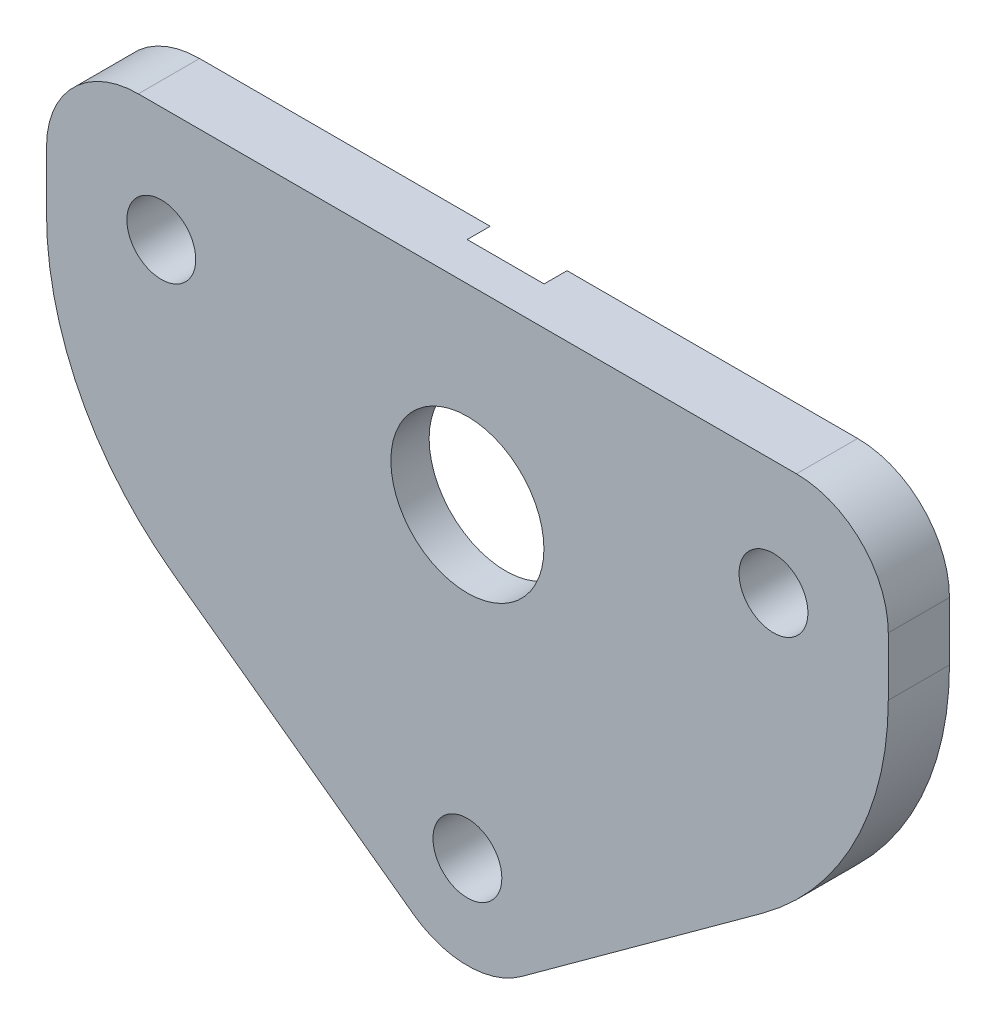
ISO-10303-21;
HEADER;
FILE_DESCRIPTION(('STEP AP214'),'2;1');
FILE_NAME('part.step','',(''),(''),'','','');
FILE_SCHEMA(('AUTOMOTIVE_DESIGN { 1 0 10303 214 1 1 1 1 }'));
ENDSEC;
DATA;
#1=APPLICATION_CONTEXT('core data for automotive mechanical design processes');
#2=APPLICATION_PROTOCOL_DEFINITION('international standard','automotive_design',2000,#1);
#3=PRODUCT_CONTEXT('',#1,'mechanical');
#4=PRODUCT('Part','Part','',(#3));
#5=PRODUCT_RELATED_PRODUCT_CATEGORY('part','',(#4));
#6=PRODUCT_DEFINITION_FORMATION('','',#4);
#7=PRODUCT_DEFINITION_CONTEXT('part definition',#1,'design');
#8=PRODUCT_DEFINITION('design','',#6,#7);
#9=PRODUCT_DEFINITION_SHAPE('','',#8);
#10=(LENGTH_UNIT() NAMED_UNIT(*) SI_UNIT(.MILLI.,.METRE.));
#11=(NAMED_UNIT(*) PLANE_ANGLE_UNIT() SI_UNIT($,.RADIAN.));
#12=(NAMED_UNIT(*) SI_UNIT($,.STERADIAN.) SOLID_ANGLE_UNIT());
#13=UNCERTAINTY_MEASURE_WITH_UNIT(LENGTH_MEASURE(1.E-05),#10,'distance_accuracy_value','');
#14=(GEOMETRIC_REPRESENTATION_CONTEXT(3) GLOBAL_UNCERTAINTY_ASSIGNED_CONTEXT((#13)) GLOBAL_UNIT_ASSIGNED_CONTEXT((#10,
#11,#12)) REPRESENTATION_CONTEXT('',''));
#15=CARTESIAN_POINT('',(0.,0.,0.));
#16=DIRECTION('',(0.,0.,1.));
#17=DIRECTION('',(1.,0.,0.));
#18=AXIS2_PLACEMENT_3D('',#15,#16,#17);
#19=CARTESIAN_POINT('',(-27.5,27.5,4.));
#20=DIRECTION('',(0.,0.,-1.));
#21=DIRECTION('',(-1.,0.,0.));
#22=AXIS2_PLACEMENT_3D('',#19,#20,#21);
#23=CYLINDRICAL_SURFACE('',#22,5.);
#24=CARTESIAN_POINT('',(-27.5,27.5,4.));
#25=DIRECTION('',(0.,0.,1.));
#26=DIRECTION('',(1.,0.,0.));
#27=AXIS2_PLACEMENT_3D('',#24,#25,#26);
#28=CIRCLE('',#27,5.);
#29=CARTESIAN_POINT('',(-22.5,27.5,4.));
#30=VERTEX_POINT('',#29);
#31=EDGE_CURVE('E223',#30,#30,#28,.T.);
#32=ORIENTED_EDGE('',*,*,#31,.T.);
#33=EDGE_LOOP('',(#32));
#34=FACE_BOUND('',#33,.T.);
#35=CARTESIAN_POINT('',(-27.5,27.5,1.5));
#36=DIRECTION('',(0.,0.,-1.));
#37=DIRECTION('',(-1.,0.,0.));
#38=AXIS2_PLACEMENT_3D('',#35,#36,#37);
#39=CIRCLE('',#38,5.);
#40=CARTESIAN_POINT('',(-32.5,27.5,1.5));
#41=VERTEX_POINT('',#40);
#42=EDGE_CURVE('E196',#41,#41,#39,.T.);
#43=ORIENTED_EDGE('',*,*,#42,.T.);
#44=EDGE_LOOP('',(#43));
#45=FACE_BOUND('',#44,.T.);
#46=ADVANCED_FACE('F32',(#34,#45),#23,.F.);
#47=CARTESIAN_POINT('',(0.,0.,4.));
#48=DIRECTION('',(0.,0.,1.));
#49=DIRECTION('',(1.,0.,0.));
#50=AXIS2_PLACEMENT_3D('',#47,#48,#49);
#51=PLANE('',#50);
#52=CARTESIAN_POINT('',(-7.5,32.5,4.));
#53=DIRECTION('',(0.,0.,1.));
#54=DIRECTION('',(1.,0.,0.));
#55=AXIS2_PLACEMENT_3D('',#52,#53,#54);
#56=CIRCLE('',#55,2.25);
#57=CARTESIAN_POINT('',(-5.25,32.5,4.));
#58=VERTEX_POINT('',#57);
#59=EDGE_CURVE('E239',#58,#58,#56,.T.);
#60=ORIENTED_EDGE('',*,*,#59,.F.);
#61=EDGE_LOOP('',(#60));
#62=FACE_BOUND('',#61,.T.);
#63=ORIENTED_EDGE('',*,*,#31,.F.);
#64=EDGE_LOOP('',(#63));
#65=FACE_BOUND('',#64,.T.);
#66=DIRECTION('',(0.,-1.,0.));
#67=VECTOR('',#66,1.);
#68=CARTESIAN_POINT('',(-55.,40.,4.));
#69=LINE('',#68,#67);
#70=CARTESIAN_POINT('',(-55.,34.,4.));
#71=VERTEX_POINT('',#70);
#72=CARTESIAN_POINT('',(-55.,30.1844918340644,4.));
#73=VERTEX_POINT('',#72);
#74=EDGE_CURVE('E143',#71,#73,#69,.T.);
#75=ORIENTED_EDGE('',*,*,#74,.T.);
#76=CARTESIAN_POINT('',(-35.,30.1844918340644,4.));
#77=DIRECTION('',(0.,0.,1.));
#78=DIRECTION('',(1.,0.,0.));
#79=AXIS2_PLACEMENT_3D('',#76,#77,#78);
#80=CIRCLE('',#79,20.);
#81=CARTESIAN_POINT('',(-46.7634339535009,14.0097701480007,4.));
#82=VERTEX_POINT('',#81);
#83=EDGE_CURVE('E189',#73,#82,#80,.T.);
#84=ORIENTED_EDGE('',*,*,#83,.T.);
#85=DIRECTION('',(0.808736084303188,-0.588171697675046,0.));
#86=VECTOR('',#85,1.);
#87=CARTESIAN_POINT('',(-55.,20.,4.));
#88=LINE('',#87,#86);
#89=CARTESIAN_POINT('',(-31.0290301860503,2.56656740803657,4.));
#90=VERTEX_POINT('',#89);
#91=EDGE_CURVE('E229',#82,#90,#88,.T.);
#92=ORIENTED_EDGE('',*,*,#91,.T.);
#93=CARTESIAN_POINT('',(-27.5,7.4189839138557,4.));
#94=DIRECTION('',(0.,0.,1.));
#95=DIRECTION('',(1.,0.,0.));
#96=AXIS2_PLACEMENT_3D('',#93,#94,#95);
#97=CIRCLE('',#96,6.);
#98=CARTESIAN_POINT('',(-23.9709698139497,2.56656740803657,4.));
#99=VERTEX_POINT('',#98);
#100=EDGE_CURVE('E166',#90,#99,#97,.T.);
#101=ORIENTED_EDGE('',*,*,#100,.T.);
#102=DIRECTION('',(0.808736084303188,0.588171697675046,0.));
#103=VECTOR('',#102,1.);
#104=CARTESIAN_POINT('',(-27.5,0.,4.));
#105=LINE('',#104,#103);
#106=CARTESIAN_POINT('',(-8.23656604649908,14.0097701480007,4.));
#107=VERTEX_POINT('',#106);
#108=EDGE_CURVE('E227',#99,#107,#105,.T.);
#109=ORIENTED_EDGE('',*,*,#108,.T.);
#110=CARTESIAN_POINT('',(-20.,30.1844918340644,4.));
#111=DIRECTION('',(0.,0.,1.));
#112=DIRECTION('',(1.,0.,0.));
#113=AXIS2_PLACEMENT_3D('',#110,#111,#112);
#114=CIRCLE('',#113,20.);
#115=CARTESIAN_POINT('',(0.,30.1844918340644,4.));
#116=VERTEX_POINT('',#115);
#117=EDGE_CURVE('E54',#107,#116,#114,.T.);
#118=ORIENTED_EDGE('',*,*,#117,.T.);
#119=DIRECTION('',(0.,1.,0.));
#120=VECTOR('',#119,1.);
#121=CARTESIAN_POINT('',(0.,40.,4.));
#122=LINE('',#121,#120);
#123=CARTESIAN_POINT('',(0.,34.,4.));
#124=VERTEX_POINT('',#123);
#125=EDGE_CURVE('E207',#116,#124,#122,.T.);
#126=ORIENTED_EDGE('',*,*,#125,.T.);
#127=CARTESIAN_POINT('',(-6.,34.,4.));
#128=DIRECTION('',(0.,0.,1.));
#129=DIRECTION('',(1.,0.,0.));
#130=AXIS2_PLACEMENT_3D('',#127,#128,#129);
#131=CIRCLE('',#130,6.);
#132=CARTESIAN_POINT('',(-6.,40.,4.));
#133=VERTEX_POINT('',#132);
#134=EDGE_CURVE('E162',#124,#133,#131,.T.);
#135=ORIENTED_EDGE('',*,*,#134,.T.);
#136=DIRECTION('',(-1.,0.,0.));
#137=VECTOR('',#136,1.);
#138=CARTESIAN_POINT('',(-55.,40.,4.));
#139=LINE('',#138,#137);
#140=CARTESIAN_POINT('',(-49.,40.,4.));
#141=VERTEX_POINT('',#140);
#142=EDGE_CURVE('E152',#133,#141,#139,.T.);
#143=ORIENTED_EDGE('',*,*,#142,.T.);
#144=CARTESIAN_POINT('',(-49.,34.,4.));
#145=DIRECTION('',(0.,0.,1.));
#146=DIRECTION('',(1.,0.,0.));
#147=AXIS2_PLACEMENT_3D('',#144,#145,#146);
#148=CIRCLE('',#147,6.);
#149=EDGE_CURVE('E164',#141,#71,#148,.T.);
#150=ORIENTED_EDGE('',*,*,#149,.T.);
#151=EDGE_LOOP('',(#75,#84,#92,#101,#109,#118,#126,#135,#143,#150));
#152=FACE_BOUND('',#151,.T.);
#153=CARTESIAN_POINT('',(-47.5,32.5,4.));
#154=DIRECTION('',(0.,0.,1.));
#155=DIRECTION('',(1.,0.,0.));
#156=AXIS2_PLACEMENT_3D('',#153,#154,#155);
#157=CIRCLE('',#156,2.25);
#158=CARTESIAN_POINT('',(-45.25,32.5,4.));
#159=VERTEX_POINT('',#158);
#160=EDGE_CURVE('E235',#159,#159,#157,.T.);
#161=ORIENTED_EDGE('',*,*,#160,.F.);
#162=EDGE_LOOP('',(#161));
#163=FACE_BOUND('',#162,.T.);
#164=CARTESIAN_POINT('',(-27.5,7.5,4.));
#165=DIRECTION('',(0.,0.,1.));
#166=DIRECTION('',(1.,0.,0.));
#167=AXIS2_PLACEMENT_3D('',#164,#165,#166);
#168=CIRCLE('',#167,2.25);
#169=CARTESIAN_POINT('',(-25.25,7.5,4.));
#170=VERTEX_POINT('',#169);
#171=EDGE_CURVE('E245',#170,#170,#168,.T.);
#172=ORIENTED_EDGE('',*,*,#171,.F.);
#173=EDGE_LOOP('',(#172));
#174=FACE_BOUND('',#173,.T.);
#175=ADVANCED_FACE('F264',(#62,#65,#152,#163,#174),#51,.T.);
#176=CARTESIAN_POINT('',(0.,0.,0.));
#177=DIRECTION('',(0.,0.,1.));
#178=DIRECTION('',(1.,0.,0.));
#179=AXIS2_PLACEMENT_3D('',#176,#177,#178);
#180=PLANE('',#179);
#181=DIRECTION('',(-1.,0.,0.));
#182=VECTOR('',#181,1.);
#183=CARTESIAN_POINT('',(-55.,40.,0.));
#184=LINE('',#183,#182);
#185=CARTESIAN_POINT('',(-30.0124689052802,40.,0.));
#186=VERTEX_POINT('',#185);
#187=CARTESIAN_POINT('',(-49.,40.,0.));
#188=VERTEX_POINT('',#187);
#189=EDGE_CURVE('E132',#186,#188,#184,.T.);
#190=ORIENTED_EDGE('',*,*,#189,.F.);
#191=CARTESIAN_POINT('',(-27.5,27.5,0.));
#192=DIRECTION('',(0.,0.,-1.));
#193=DIRECTION('',(-1.,0.,0.));
#194=AXIS2_PLACEMENT_3D('',#191,#192,#193);
#195=CIRCLE('',#194,12.75);
#196=CARTESIAN_POINT('',(-24.9875310947198,40.,0.));
#197=VERTEX_POINT('',#196);
#198=EDGE_CURVE('E121',#197,#186,#195,.T.);
#199=ORIENTED_EDGE('',*,*,#198,.F.);
#200=CARTESIAN_POINT('',(-6.,40.,0.));
#201=VERTEX_POINT('',#200);
#202=EDGE_CURVE('E140',#201,#197,#184,.T.);
#203=ORIENTED_EDGE('',*,*,#202,.F.);
#204=CARTESIAN_POINT('',(-6.,34.,0.));
#205=DIRECTION('',(0.,0.,1.));
#206=DIRECTION('',(1.,0.,0.));
#207=AXIS2_PLACEMENT_3D('',#204,#205,#206);
#208=CIRCLE('',#207,6.);
#209=CARTESIAN_POINT('',(0.,34.,0.));
#210=VERTEX_POINT('',#209);
#211=EDGE_CURVE('E151',#201,#210,#208,.F.);
#212=ORIENTED_EDGE('',*,*,#211,.T.);
#213=DIRECTION('',(0.,1.,0.));
#214=VECTOR('',#213,1.);
#215=CARTESIAN_POINT('',(0.,40.,0.));
#216=LINE('',#215,#214);
#217=CARTESIAN_POINT('',(0.,30.1844918340644,0.));
#218=VERTEX_POINT('',#217);
#219=EDGE_CURVE('E141',#218,#210,#216,.T.);
#220=ORIENTED_EDGE('',*,*,#219,.F.);
#221=CARTESIAN_POINT('',(-20.,30.1844918340644,0.));
#222=DIRECTION('',(0.,0.,1.));
#223=DIRECTION('',(1.,0.,0.));
#224=AXIS2_PLACEMENT_3D('',#221,#222,#223);
#225=CIRCLE('',#224,20.);
#226=CARTESIAN_POINT('',(-8.23656604649908,14.0097701480007,0.));
#227=VERTEX_POINT('',#226);
#228=EDGE_CURVE('E182',#218,#227,#225,.F.);
#229=ORIENTED_EDGE('',*,*,#228,.T.);
#230=DIRECTION('',(0.808736084303188,0.588171697675046,0.));
#231=VECTOR('',#230,1.);
#232=CARTESIAN_POINT('',(-27.5,0.,0.));
#233=LINE('',#232,#231);
#234=CARTESIAN_POINT('',(-23.9709698139497,2.56656740803657,0.));
#235=VERTEX_POINT('',#234);
#236=EDGE_CURVE('E144',#235,#227,#233,.T.);
#237=ORIENTED_EDGE('',*,*,#236,.F.);
#238=CARTESIAN_POINT('',(-27.5,7.4189839138557,0.));
#239=DIRECTION('',(0.,0.,1.));
#240=DIRECTION('',(1.,0.,0.));
#241=AXIS2_PLACEMENT_3D('',#238,#239,#240);
#242=CIRCLE('',#241,6.);
#243=CARTESIAN_POINT('',(-31.0290301860503,2.56656740803657,0.));
#244=VERTEX_POINT('',#243);
#245=EDGE_CURVE('E156',#235,#244,#242,.F.);
#246=ORIENTED_EDGE('',*,*,#245,.T.);
#247=DIRECTION('',(0.808736084303188,-0.588171697675046,0.));
#248=VECTOR('',#247,1.);
#249=CARTESIAN_POINT('',(-55.,20.,0.));
#250=LINE('',#249,#248);
#251=CARTESIAN_POINT('',(-46.7634339535009,14.0097701480007,0.));
#252=VERTEX_POINT('',#251);
#253=EDGE_CURVE('E217',#252,#244,#250,.T.);
#254=ORIENTED_EDGE('',*,*,#253,.F.);
#255=CARTESIAN_POINT('',(-35.,30.1844918340644,0.));
#256=DIRECTION('',(0.,0.,1.));
#257=DIRECTION('',(1.,0.,0.));
#258=AXIS2_PLACEMENT_3D('',#255,#256,#257);
#259=CIRCLE('',#258,20.);
#260=CARTESIAN_POINT('',(-55.,30.1844918340644,0.));
#261=VERTEX_POINT('',#260);
#262=EDGE_CURVE('E184',#252,#261,#259,.F.);
#263=ORIENTED_EDGE('',*,*,#262,.T.);
#264=DIRECTION('',(0.,-1.,0.));
#265=VECTOR('',#264,1.);
#266=CARTESIAN_POINT('',(-55.,40.,0.));
#267=LINE('',#266,#265);
#268=CARTESIAN_POINT('',(-55.,34.,0.));
#269=VERTEX_POINT('',#268);
#270=EDGE_CURVE('E218',#269,#261,#267,.T.);
#271=ORIENTED_EDGE('',*,*,#270,.F.);
#272=CARTESIAN_POINT('',(-49.,34.,0.));
#273=DIRECTION('',(0.,0.,1.));
#274=DIRECTION('',(1.,0.,0.));
#275=AXIS2_PLACEMENT_3D('',#272,#273,#274);
#276=CIRCLE('',#275,6.);
#277=EDGE_CURVE('E138',#269,#188,#276,.F.);
#278=ORIENTED_EDGE('',*,*,#277,.T.);
#279=EDGE_LOOP('',(#190,#199,#203,#212,#220,#229,#237,#246,#254,#263,#271,#278));
#280=FACE_BOUND('',#279,.T.);
#281=CARTESIAN_POINT('',(-47.5,32.5,0.));
#282=DIRECTION('',(0.,0.,1.));
#283=DIRECTION('',(1.,0.,0.));
#284=AXIS2_PLACEMENT_3D('',#281,#282,#283);
#285=CIRCLE('',#284,2.25);
#286=CARTESIAN_POINT('',(-45.25,32.5,0.));
#287=VERTEX_POINT('',#286);
#288=EDGE_CURVE('E236',#287,#287,#285,.T.);
#289=ORIENTED_EDGE('',*,*,#288,.T.);
#290=EDGE_LOOP('',(#289));
#291=FACE_BOUND('',#290,.T.);
#292=CARTESIAN_POINT('',(-7.5,32.5,0.));
#293=DIRECTION('',(0.,0.,1.));
#294=DIRECTION('',(1.,0.,0.));
#295=AXIS2_PLACEMENT_3D('',#292,#293,#294);
#296=CIRCLE('',#295,2.25);
#297=CARTESIAN_POINT('',(-5.25,32.5,0.));
#298=VERTEX_POINT('',#297);
#299=EDGE_CURVE('E242',#298,#298,#296,.T.);
#300=ORIENTED_EDGE('',*,*,#299,.T.);
#301=EDGE_LOOP('',(#300));
#302=FACE_BOUND('',#301,.T.);
#303=CARTESIAN_POINT('',(-27.5,7.5,0.));
#304=DIRECTION('',(0.,0.,1.));
#305=DIRECTION('',(1.,0.,0.));
#306=AXIS2_PLACEMENT_3D('',#303,#304,#305);
#307=CIRCLE('',#306,2.25);
#308=CARTESIAN_POINT('',(-25.25,7.5,0.));
#309=VERTEX_POINT('',#308);
#310=EDGE_CURVE('E248',#309,#309,#307,.T.);
#311=ORIENTED_EDGE('',*,*,#310,.T.);
#312=EDGE_LOOP('',(#311));
#313=FACE_BOUND('',#312,.T.);
#314=ADVANCED_FACE('F135',(#280,#291,#302,#313),#180,.F.);
#315=CARTESIAN_POINT('',(-55.,40.,4.));
#316=DIRECTION('',(1.,0.,0.));
#317=DIRECTION('',(0.,1.,0.));
#318=AXIS2_PLACEMENT_3D('',#315,#316,#317);
#319=PLANE('',#318);
#320=ORIENTED_EDGE('',*,*,#270,.T.);
#321=DIRECTION('',(0.,0.,-1.));
#322=VECTOR('',#321,1.);
#323=CARTESIAN_POINT('',(-55.,30.1844918340644,4.));
#324=LINE('',#323,#322);
#325=EDGE_CURVE('E186',#261,#73,#324,.F.);
#326=ORIENTED_EDGE('',*,*,#325,.T.);
#327=ORIENTED_EDGE('',*,*,#74,.F.);
#328=DIRECTION('',(0.,0.,-1.));
#329=VECTOR('',#328,1.);
#330=CARTESIAN_POINT('',(-55.,34.,4.));
#331=LINE('',#330,#329);
#332=EDGE_CURVE('E168',#71,#269,#331,.T.);
#333=ORIENTED_EDGE('',*,*,#332,.T.);
#334=EDGE_LOOP('',(#320,#326,#327,#333));
#335=FACE_BOUND('',#334,.T.);
#336=ADVANCED_FACE('F279',(#335),#319,.F.);
#337=CARTESIAN_POINT('',(-55.,20.,4.));
#338=DIRECTION('',(0.588171697675046,0.808736084303189,0.));
#339=DIRECTION('',(-0.808736084303189,0.588171697675046,0.));
#340=AXIS2_PLACEMENT_3D('',#337,#338,#339);
#341=PLANE('',#340);
#342=ORIENTED_EDGE('',*,*,#91,.F.);
#343=DIRECTION('',(0.,0.,-1.));
#344=VECTOR('',#343,1.);
#345=CARTESIAN_POINT('',(-46.7634339535009,14.0097701480007,4.));
#346=LINE('',#345,#344);
#347=EDGE_CURVE('E179',#82,#252,#346,.T.);
#348=ORIENTED_EDGE('',*,*,#347,.T.);
#349=ORIENTED_EDGE('',*,*,#253,.T.);
#350=DIRECTION('',(0.,0.,-1.));
#351=VECTOR('',#350,1.);
#352=CARTESIAN_POINT('',(-31.0290301860503,2.56656740803657,4.));
#353=LINE('',#352,#351);
#354=EDGE_CURVE('E159',#244,#90,#353,.F.);
#355=ORIENTED_EDGE('',*,*,#354,.T.);
#356=EDGE_LOOP('',(#342,#348,#349,#355));
#357=FACE_BOUND('',#356,.T.);
#358=ADVANCED_FACE('F286',(#357),#341,.F.);
#359=CARTESIAN_POINT('',(-27.5,0.,4.));
#360=DIRECTION('',(-0.588171697675046,0.808736084303189,0.));
#361=DIRECTION('',(-0.808736084303189,-0.588171697675046,0.));
#362=AXIS2_PLACEMENT_3D('',#359,#360,#361);
#363=PLANE('',#362);
#364=ORIENTED_EDGE('',*,*,#236,.T.);
#365=DIRECTION('',(0.,0.,-1.));
#366=VECTOR('',#365,1.);
#367=CARTESIAN_POINT('',(-8.23656604649908,14.0097701480007,4.));
#368=LINE('',#367,#366);
#369=EDGE_CURVE('E194',#227,#107,#368,.F.);
#370=ORIENTED_EDGE('',*,*,#369,.T.);
#371=ORIENTED_EDGE('',*,*,#108,.F.);
#372=DIRECTION('',(0.,0.,-1.));
#373=VECTOR('',#372,1.);
#374=CARTESIAN_POINT('',(-23.9709698139497,2.56656740803657,4.));
#375=LINE('',#374,#373);
#376=EDGE_CURVE('E148',#99,#235,#375,.T.);
#377=ORIENTED_EDGE('',*,*,#376,.T.);
#378=EDGE_LOOP('',(#364,#370,#371,#377));
#379=FACE_BOUND('',#378,.T.);
#380=ADVANCED_FACE('F214',(#379),#363,.F.);
#381=CARTESIAN_POINT('',(0.,40.,4.));
#382=DIRECTION('',(-1.,0.,0.));
#383=DIRECTION('',(0.,0.,1.));
#384=AXIS2_PLACEMENT_3D('',#381,#382,#383);
#385=PLANE('',#384);
#386=ORIENTED_EDGE('',*,*,#125,.F.);
#387=DIRECTION('',(0.,0.,-1.));
#388=VECTOR('',#387,1.);
#389=CARTESIAN_POINT('',(0.,30.1844918340644,4.));
#390=LINE('',#389,#388);
#391=EDGE_CURVE('E191',#116,#218,#390,.T.);
#392=ORIENTED_EDGE('',*,*,#391,.T.);
#393=ORIENTED_EDGE('',*,*,#219,.T.);
#394=DIRECTION('',(0.,0.,-1.));
#395=VECTOR('',#394,1.);
#396=CARTESIAN_POINT('',(0.,34.,4.));
#397=LINE('',#396,#395);
#398=EDGE_CURVE('E176',#210,#124,#397,.F.);
#399=ORIENTED_EDGE('',*,*,#398,.T.);
#400=EDGE_LOOP('',(#386,#392,#393,#399));
#401=FACE_BOUND('',#400,.T.);
#402=ADVANCED_FACE('F206',(#401),#385,.F.);
#403=CARTESIAN_POINT('',(-55.,40.,4.));
#404=DIRECTION('',(0.,-1.,0.));
#405=DIRECTION('',(0.,0.,-1.));
#406=AXIS2_PLACEMENT_3D('',#403,#404,#405);
#407=PLANE('',#406);
#408=DIRECTION('',(1.,0.,0.));
#409=VECTOR('',#408,1.);
#410=CARTESIAN_POINT('',(-55.,40.,1.5));
#411=LINE('',#410,#409);
#412=CARTESIAN_POINT('',(-30.0124689052802,40.,1.5));
#413=VERTEX_POINT('',#412);
#414=CARTESIAN_POINT('',(-24.9875310947198,40.,1.5));
#415=VERTEX_POINT('',#414);
#416=EDGE_CURVE('E134',#413,#415,#411,.T.);
#417=ORIENTED_EDGE('',*,*,#416,.F.);
#418=DIRECTION('',(0.,0.,-1.));
#419=VECTOR('',#418,1.);
#420=CARTESIAN_POINT('',(-30.0124689052802,40.,1.5));
#421=LINE('',#420,#419);
#422=EDGE_CURVE('E11',#413,#186,#421,.T.);
#423=ORIENTED_EDGE('',*,*,#422,.T.);
#424=ORIENTED_EDGE('',*,*,#189,.T.);
#425=DIRECTION('',(0.,0.,-1.));
#426=VECTOR('',#425,1.);
#427=CARTESIAN_POINT('',(-49.,40.,4.));
#428=LINE('',#427,#426);
#429=EDGE_CURVE('E174',#188,#141,#428,.F.);
#430=ORIENTED_EDGE('',*,*,#429,.T.);
#431=ORIENTED_EDGE('',*,*,#142,.F.);
#432=DIRECTION('',(0.,0.,-1.));
#433=VECTOR('',#432,1.);
#434=CARTESIAN_POINT('',(-6.,40.,4.));
#435=LINE('',#434,#433);
#436=EDGE_CURVE('E171',#133,#201,#435,.T.);
#437=ORIENTED_EDGE('',*,*,#436,.T.);
#438=ORIENTED_EDGE('',*,*,#202,.T.);
#439=DIRECTION('',(0.,0.,-1.));
#440=VECTOR('',#439,1.);
#441=CARTESIAN_POINT('',(-24.9875310947198,40.,1.5));
#442=LINE('',#441,#440);
#443=EDGE_CURVE('E40',#197,#415,#442,.F.);
#444=ORIENTED_EDGE('',*,*,#443,.T.);
#445=EDGE_LOOP('',(#417,#423,#424,#430,#431,#437,#438,#444));
#446=FACE_BOUND('',#445,.T.);
#447=ADVANCED_FACE('F131',(#446),#407,.F.);
#448=CARTESIAN_POINT('',(-47.5,32.5,4.));
#449=DIRECTION('',(0.,0.,-1.));
#450=DIRECTION('',(-1.,0.,0.));
#451=AXIS2_PLACEMENT_3D('',#448,#449,#450);
#452=CYLINDRICAL_SURFACE('',#451,2.25);
#453=ORIENTED_EDGE('',*,*,#160,.T.);
#454=EDGE_LOOP('',(#453));
#455=FACE_BOUND('',#454,.T.);
#456=ORIENTED_EDGE('',*,*,#288,.F.);
#457=EDGE_LOOP('',(#456));
#458=FACE_BOUND('',#457,.T.);
#459=ADVANCED_FACE('F274',(#455,#458),#452,.F.);
#460=CARTESIAN_POINT('',(-7.5,32.5,4.));
#461=DIRECTION('',(0.,0.,-1.));
#462=DIRECTION('',(-1.,0.,0.));
#463=AXIS2_PLACEMENT_3D('',#460,#461,#462);
#464=CYLINDRICAL_SURFACE('',#463,2.25);
#465=ORIENTED_EDGE('',*,*,#59,.T.);
#466=EDGE_LOOP('',(#465));
#467=FACE_BOUND('',#466,.T.);
#468=ORIENTED_EDGE('',*,*,#299,.F.);
#469=EDGE_LOOP('',(#468));
#470=FACE_BOUND('',#469,.T.);
#471=ADVANCED_FACE('F326',(#467,#470),#464,.F.);
#472=CARTESIAN_POINT('',(-27.5,7.5,4.));
#473=DIRECTION('',(0.,0.,-1.));
#474=DIRECTION('',(-1.,0.,0.));
#475=AXIS2_PLACEMENT_3D('',#472,#473,#474);
#476=CYLINDRICAL_SURFACE('',#475,2.25);
#477=ORIENTED_EDGE('',*,*,#171,.T.);
#478=EDGE_LOOP('',(#477));
#479=FACE_BOUND('',#478,.T.);
#480=ORIENTED_EDGE('',*,*,#310,.F.);
#481=EDGE_LOOP('',(#480));
#482=FACE_BOUND('',#481,.T.);
#483=ADVANCED_FACE('F297',(#479,#482),#476,.F.);
#484=CARTESIAN_POINT('',(-27.5,7.4189839138557,4.));
#485=DIRECTION('',(0.,0.,-1.));
#486=DIRECTION('',(-1.,0.,0.));
#487=AXIS2_PLACEMENT_3D('',#484,#485,#486);
#488=CYLINDRICAL_SURFACE('',#487,6.);
#489=ORIENTED_EDGE('',*,*,#100,.F.);
#490=ORIENTED_EDGE('',*,*,#354,.F.);
#491=ORIENTED_EDGE('',*,*,#245,.F.);
#492=ORIENTED_EDGE('',*,*,#376,.F.);
#493=EDGE_LOOP('',(#489,#490,#491,#492));
#494=FACE_BOUND('',#493,.T.);
#495=ADVANCED_FACE('F293',(#494),#488,.T.);
#496=CARTESIAN_POINT('',(-49.,34.,4.));
#497=DIRECTION('',(0.,0.,-1.));
#498=DIRECTION('',(-1.,0.,0.));
#499=AXIS2_PLACEMENT_3D('',#496,#497,#498);
#500=CYLINDRICAL_SURFACE('',#499,6.);
#501=ORIENTED_EDGE('',*,*,#149,.F.);
#502=ORIENTED_EDGE('',*,*,#429,.F.);
#503=ORIENTED_EDGE('',*,*,#277,.F.);
#504=ORIENTED_EDGE('',*,*,#332,.F.);
#505=EDGE_LOOP('',(#501,#502,#503,#504));
#506=FACE_BOUND('',#505,.T.);
#507=ADVANCED_FACE('F296',(#506),#500,.T.);
#508=CARTESIAN_POINT('',(-6.,34.,4.));
#509=DIRECTION('',(0.,0.,-1.));
#510=DIRECTION('',(-1.,0.,0.));
#511=AXIS2_PLACEMENT_3D('',#508,#509,#510);
#512=CYLINDRICAL_SURFACE('',#511,6.);
#513=ORIENTED_EDGE('',*,*,#134,.F.);
#514=ORIENTED_EDGE('',*,*,#398,.F.);
#515=ORIENTED_EDGE('',*,*,#211,.F.);
#516=ORIENTED_EDGE('',*,*,#436,.F.);
#517=EDGE_LOOP('',(#513,#514,#515,#516));
#518=FACE_BOUND('',#517,.T.);
#519=ADVANCED_FACE('F204',(#518),#512,.T.);
#520=CARTESIAN_POINT('',(-35.,30.1844918340644,4.));
#521=DIRECTION('',(0.,0.,-1.));
#522=DIRECTION('',(-1.,0.,0.));
#523=AXIS2_PLACEMENT_3D('',#520,#521,#522);
#524=CYLINDRICAL_SURFACE('',#523,20.);
#525=ORIENTED_EDGE('',*,*,#83,.F.);
#526=ORIENTED_EDGE('',*,*,#325,.F.);
#527=ORIENTED_EDGE('',*,*,#262,.F.);
#528=ORIENTED_EDGE('',*,*,#347,.F.);
#529=EDGE_LOOP('',(#525,#526,#527,#528));
#530=FACE_BOUND('',#529,.T.);
#531=ADVANCED_FACE('F303',(#530),#524,.T.);
#532=CARTESIAN_POINT('',(-20.,30.1844918340644,4.));
#533=DIRECTION('',(0.,0.,-1.));
#534=DIRECTION('',(-1.,0.,0.));
#535=AXIS2_PLACEMENT_3D('',#532,#533,#534);
#536=CYLINDRICAL_SURFACE('',#535,20.);
#537=ORIENTED_EDGE('',*,*,#117,.F.);
#538=ORIENTED_EDGE('',*,*,#369,.F.);
#539=ORIENTED_EDGE('',*,*,#228,.F.);
#540=ORIENTED_EDGE('',*,*,#391,.F.);
#541=EDGE_LOOP('',(#537,#538,#539,#540));
#542=FACE_BOUND('',#541,.T.);
#543=ADVANCED_FACE('F34',(#542),#536,.T.);
#544=CARTESIAN_POINT('',(-27.5,27.5,1.5));
#545=DIRECTION('',(0.,0.,-1.));
#546=DIRECTION('',(-1.,0.,0.));
#547=AXIS2_PLACEMENT_3D('',#544,#545,#546);
#548=CYLINDRICAL_SURFACE('',#547,12.75);
#549=CARTESIAN_POINT('',(-27.5,27.5,1.5));
#550=DIRECTION('',(0.,0.,-1.));
#551=DIRECTION('',(-1.,0.,0.));
#552=AXIS2_PLACEMENT_3D('',#549,#550,#551);
#553=CIRCLE('',#552,12.75);
#554=EDGE_CURVE('E46',#415,#413,#553,.T.);
#555=ORIENTED_EDGE('',*,*,#554,.F.);
#556=ORIENTED_EDGE('',*,*,#443,.F.);
#557=ORIENTED_EDGE('',*,*,#198,.T.);
#558=ORIENTED_EDGE('',*,*,#422,.F.);
#559=EDGE_LOOP('',(#555,#556,#557,#558));
#560=FACE_BOUND('',#559,.T.);
#561=ADVANCED_FACE('F122',(#560),#548,.F.);
#562=CARTESIAN_POINT('',(-27.5,27.5,1.5));
#563=DIRECTION('',(0.,0.,-1.));
#564=DIRECTION('',(-1.,0.,0.));
#565=AXIS2_PLACEMENT_3D('',#562,#563,#564);
#566=PLANE('',#565);
#567=ORIENTED_EDGE('',*,*,#42,.F.);
#568=EDGE_LOOP('',(#567));
#569=FACE_BOUND('',#568,.T.);
#570=ORIENTED_EDGE('',*,*,#416,.T.);
#571=ORIENTED_EDGE('',*,*,#554,.T.);
#572=EDGE_LOOP('',(#570,#571));
#573=FACE_BOUND('',#572,.T.);
#574=ADVANCED_FACE('F254',(#569,#573),#566,.T.);
#575=CLOSED_SHELL('',(#46,#175,#314,#336,#358,#380,#402,#447,#459,#471,#483,#495,#507,#519,#531,
#543,#561,#574));
#576=MANIFOLD_SOLID_BREP('B2',#575);
#577=ADVANCED_BREP_SHAPE_REPRESENTATION('',(#18,#576),#14);
#578=SHAPE_DEFINITION_REPRESENTATION(#9,#577);
ENDSEC;
END-ISO-10303-21;
